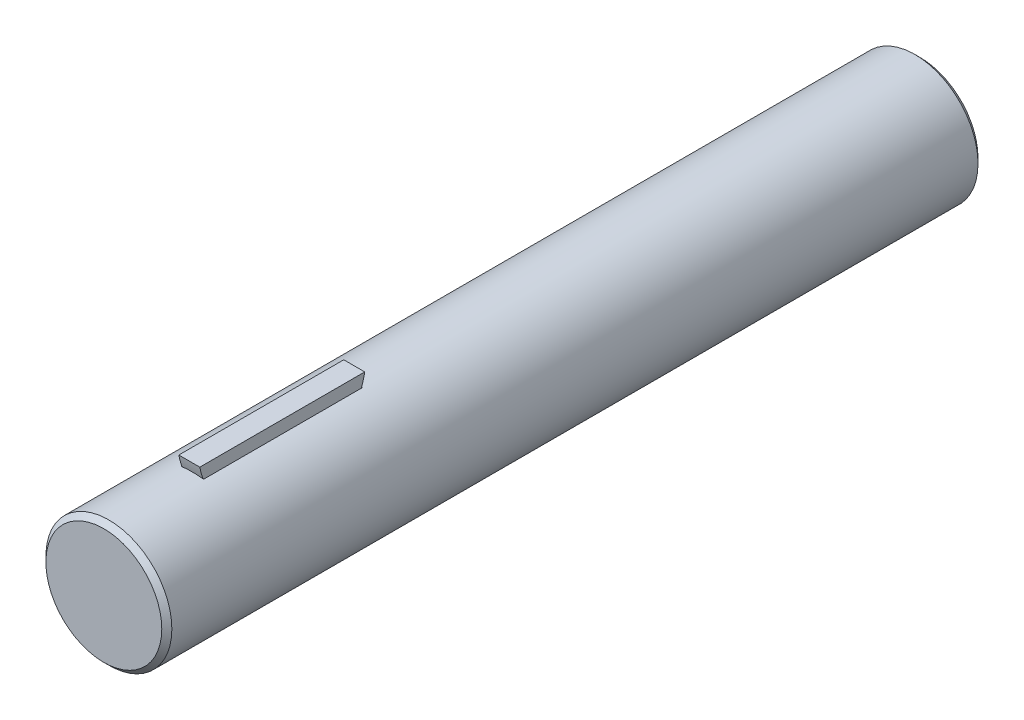
ISO-10303-21;
HEADER;
FILE_DESCRIPTION(('STEP AP214'),'2;1');
FILE_NAME('part.step','',(''),(''),'','','');
FILE_SCHEMA(('AUTOMOTIVE_DESIGN { 1 0 10303 214 1 1 1 1 }'));
ENDSEC;
DATA;
#1=APPLICATION_CONTEXT('core data for automotive mechanical design processes');
#2=APPLICATION_PROTOCOL_DEFINITION('international standard','automotive_design',2000,#1);
#3=PRODUCT_CONTEXT('',#1,'mechanical');
#4=PRODUCT('Part','Part','',(#3));
#5=PRODUCT_RELATED_PRODUCT_CATEGORY('part','',(#4));
#6=PRODUCT_DEFINITION_FORMATION('','',#4);
#7=PRODUCT_DEFINITION_CONTEXT('part definition',#1,'design');
#8=PRODUCT_DEFINITION('design','',#6,#7);
#9=PRODUCT_DEFINITION_SHAPE('','',#8);
#10=(LENGTH_UNIT() NAMED_UNIT(*) SI_UNIT(.MILLI.,.METRE.));
#11=(NAMED_UNIT(*) PLANE_ANGLE_UNIT() SI_UNIT($,.RADIAN.));
#12=(NAMED_UNIT(*) SI_UNIT($,.STERADIAN.) SOLID_ANGLE_UNIT());
#13=UNCERTAINTY_MEASURE_WITH_UNIT(LENGTH_MEASURE(1.E-05),#10,'distance_accuracy_value','');
#14=(GEOMETRIC_REPRESENTATION_CONTEXT(3) GLOBAL_UNCERTAINTY_ASSIGNED_CONTEXT((#13)) GLOBAL_UNIT_ASSIGNED_CONTEXT((#10,
#11,#12)) REPRESENTATION_CONTEXT('',''));
#15=CARTESIAN_POINT('',(0.,0.,0.));
#16=DIRECTION('',(0.,0.,1.));
#17=DIRECTION('',(1.,0.,0.));
#18=AXIS2_PLACEMENT_3D('',#15,#16,#17);
#19=CARTESIAN_POINT('',(-0.84455,6.77469380938872,31.623));
#20=DIRECTION('',(1.,0.,0.));
#21=DIRECTION('',(0.,0.,-1.));
#22=AXIS2_PLACEMENT_3D('',#19,#20,#21);
#23=CYLINDRICAL_SURFACE('',#22,6.35);
#24=CARTESIAN_POINT('',(-0.79375,6.77469380938872,31.623));
#25=DIRECTION('',(1.,0.,0.));
#26=DIRECTION('',(0.,0.,-1.));
#27=AXIS2_PLACEMENT_3D('',#24,#25,#26);
#28=CIRCLE('',#27,6.35);
#29=CARTESIAN_POINT('',(-0.79375,4.69588832783532,25.6229110198378));
#30=VERTEX_POINT('',#29);
#31=CARTESIAN_POINT('',(-0.79375,4.69588832783528,37.6230889801623));
#32=VERTEX_POINT('',#31);
#33=EDGE_CURVE('E42',#30,#32,#28,.F.);
#34=ORIENTED_EDGE('',*,*,#33,.F.);
#35=CARTESIAN_POINT('',(-0.84455,4.68701840699394,25.625991461217));
#36=CARTESIAN_POINT('',(-0.704848469321318,4.71221629983658,25.6172638180687));
#37=CARTESIAN_POINT('',(-0.563883269231341,4.73114237463684,25.6108088330229));
#38=CARTESIAN_POINT('',(-0.281938047237513,4.75622890974669,25.6023186504898));
#39=CARTESIAN_POINT('',(-0.140969023618757,4.7625,25.6002451425068));
#40=CARTESIAN_POINT('',(0.140969023618755,4.7625,25.6002451425068));
#41=CARTESIAN_POINT('',(0.281938047237511,4.75622890974669,25.6023186504898));
#42=CARTESIAN_POINT('',(0.563883269231338,4.73114237463684,25.6108088330229));
#43=CARTESIAN_POINT('',(0.704848469321315,4.71221629983658,25.6172638180687));
#44=CARTESIAN_POINT('',(0.844549999999998,4.68701840699394,25.625991461217));
#45=B_SPLINE_CURVE_WITH_KNOTS('',3,(#35,#36,#37,#38,#39,#40,#41,#42,#43,#44),.UNSPECIFIED.,.F.,
.F.,(4,2,2,2,4),(0.,0.426497298913169,0.84924971727627,1.27200213563937,1.69849943455254),.UNSPECIFIED.);
#46=CARTESIAN_POINT('',(-0.84455,4.68701840699394,25.625991461217));
#47=VERTEX_POINT('',#46);
#48=EDGE_CURVE('E150',#47,#30,#45,.T.);
#49=ORIENTED_EDGE('',*,*,#48,.F.);
#50=CARTESIAN_POINT('',(-0.84455,6.77469380938872,31.623));
#51=DIRECTION('',(1.,0.,0.));
#52=DIRECTION('',(0.,0.,-1.));
#53=AXIS2_PLACEMENT_3D('',#50,#51,#52);
#54=CIRCLE('',#53,6.35);
#55=CARTESIAN_POINT('',(-0.84455,4.68701840699394,37.620008538783));
#56=VERTEX_POINT('',#55);
#57=EDGE_CURVE('E121',#56,#47,#54,.T.);
#58=ORIENTED_EDGE('',*,*,#57,.F.);
#59=CARTESIAN_POINT('',(0.84455,4.68701840699394,37.620008538783));
#60=CARTESIAN_POINT('',(0.704848469321317,4.71221629983658,37.6287361819313));
#61=CARTESIAN_POINT('',(0.563883269231341,4.73114237463684,37.6351911669771));
#62=CARTESIAN_POINT('',(0.281938047237513,4.75622890974669,37.6436813495102));
#63=CARTESIAN_POINT('',(0.140969023618757,4.7625,37.6457548574932));
#64=CARTESIAN_POINT('',(-0.140969023618755,4.7625,37.6457548574932));
#65=CARTESIAN_POINT('',(-0.281938047237511,4.75622890974669,37.6436813495102));
#66=CARTESIAN_POINT('',(-0.563883269231338,4.73114237463684,37.6351911669771));
#67=CARTESIAN_POINT('',(-0.704848469321315,4.71221629983658,37.6287361819313));
#68=CARTESIAN_POINT('',(-0.844549999999998,4.68701840699394,37.620008538783));
#69=B_SPLINE_CURVE_WITH_KNOTS('',3,(#59,#60,#61,#62,#63,#64,#65,#66,#67,#68),.UNSPECIFIED.,.F.,
.F.,(4,2,2,2,4),(0.,0.42649729891317,0.84924971727627,1.27200213563937,1.69849943455254),.UNSPECIFIED.);
#70=EDGE_CURVE('E139',#32,#56,#69,.T.);
#71=ORIENTED_EDGE('',*,*,#70,.F.);
#72=EDGE_LOOP('',(#34,#49,#58,#71));
#73=FACE_BOUND('',#72,.T.);
#74=ADVANCED_FACE('F34',(#73),#23,.F.);
#75=CARTESIAN_POINT('',(0.,0.,-17.399));
#76=DIRECTION('',(0.,0.,1.));
#77=DIRECTION('',(1.,0.,0.));
#78=AXIS2_PLACEMENT_3D('',#75,#76,#77);
#79=CYLINDRICAL_SURFACE('',#78,4.7625);
#80=CARTESIAN_POINT('',(0.,0.,-17.018));
#81=DIRECTION('',(0.,0.,1.));
#82=DIRECTION('',(1.,0.,0.));
#83=AXIS2_PLACEMENT_3D('',#80,#81,#82);
#84=CIRCLE('',#83,4.7625);
#85=CARTESIAN_POINT('',(4.7625,0.,-17.018));
#86=VERTEX_POINT('',#85);
#87=EDGE_CURVE('E127',#86,#86,#84,.T.);
#88=ORIENTED_EDGE('',*,*,#87,.T.);
#89=EDGE_LOOP('',(#88));
#90=FACE_BOUND('',#89,.T.);
#91=CARTESIAN_POINT('',(0.,0.,43.942));
#92=DIRECTION('',(0.,0.,1.));
#93=DIRECTION('',(1.,0.,0.));
#94=AXIS2_PLACEMENT_3D('',#91,#92,#93);
#95=CIRCLE('',#94,4.7625);
#96=CARTESIAN_POINT('',(4.7625,0.,43.942));
#97=VERTEX_POINT('',#96);
#98=EDGE_CURVE('E130',#97,#97,#95,.T.);
#99=ORIENTED_EDGE('',*,*,#98,.F.);
#100=EDGE_LOOP('',(#99));
#101=FACE_BOUND('',#100,.T.);
#102=DIRECTION('',(0.,0.,1.));
#103=VECTOR('',#102,1.);
#104=CARTESIAN_POINT('',(-0.84455,4.68701840699394,-17.399));
#105=LINE('',#104,#103);
#106=EDGE_CURVE('E194',#47,#56,#105,.T.);
#107=ORIENTED_EDGE('',*,*,#106,.F.);
#108=ORIENTED_EDGE('',*,*,#48,.T.);
#109=CARTESIAN_POINT('',(0.79375,4.69588832783532,25.6229110198378));
#110=VERTEX_POINT('',#109);
#111=EDGE_CURVE('E93',#30,#110,#45,.T.);
#112=ORIENTED_EDGE('',*,*,#111,.T.);
#113=CARTESIAN_POINT('',(0.84455,4.68701840699394,25.625991461217));
#114=VERTEX_POINT('',#113);
#115=EDGE_CURVE('E148',#110,#114,#45,.T.);
#116=ORIENTED_EDGE('',*,*,#115,.T.);
#117=DIRECTION('',(0.,0.,1.));
#118=VECTOR('',#117,1.);
#119=CARTESIAN_POINT('',(0.84455,4.68701840699394,-17.399));
#120=LINE('',#119,#118);
#121=CARTESIAN_POINT('',(0.84455,4.68701840699394,37.620008538783));
#122=VERTEX_POINT('',#121);
#123=EDGE_CURVE('E136',#114,#122,#120,.T.);
#124=ORIENTED_EDGE('',*,*,#123,.T.);
#125=CARTESIAN_POINT('',(0.79375,4.69588832783532,37.6230889801622));
#126=VERTEX_POINT('',#125);
#127=EDGE_CURVE('E140',#122,#126,#69,.T.);
#128=ORIENTED_EDGE('',*,*,#127,.T.);
#129=EDGE_CURVE('E149',#126,#32,#69,.T.);
#130=ORIENTED_EDGE('',*,*,#129,.T.);
#131=ORIENTED_EDGE('',*,*,#70,.T.);
#132=EDGE_LOOP('',(#107,#108,#112,#116,#124,#128,#130,#131));
#133=FACE_BOUND('',#132,.T.);
#134=ADVANCED_FACE('F155',(#90,#101,#133),#79,.T.);
#135=CARTESIAN_POINT('',(0.,0.,44.323));
#136=DIRECTION('',(0.,0.,-1.));
#137=DIRECTION('',(-1.,0.,0.));
#138=AXIS2_PLACEMENT_3D('',#135,#136,#137);
#139=PLANE('',#138);
#140=CARTESIAN_POINT('',(0.,0.,44.323));
#141=DIRECTION('',(0.,0.,1.));
#142=DIRECTION('',(1.,0.,0.));
#143=AXIS2_PLACEMENT_3D('',#140,#141,#142);
#144=CIRCLE('',#143,4.3815);
#145=CARTESIAN_POINT('',(4.3815,0.,44.323));
#146=VERTEX_POINT('',#145);
#147=EDGE_CURVE('E133',#146,#146,#144,.T.);
#148=ORIENTED_EDGE('',*,*,#147,.T.);
#149=EDGE_LOOP('',(#148));
#150=FACE_BOUND('',#149,.T.);
#151=ADVANCED_FACE('F36',(#150),#139,.F.);
#152=CARTESIAN_POINT('',(0.,0.,43.942));
#153=DIRECTION('',(0.,0.,-1.));
#154=DIRECTION('',(-1.,0.,0.));
#155=AXIS2_PLACEMENT_3D('',#152,#153,#154);
#156=CONICAL_SURFACE('',#155,4.7625,0.785398163397459);
#157=ORIENTED_EDGE('',*,*,#147,.F.);
#158=EDGE_LOOP('',(#157));
#159=FACE_BOUND('',#158,.T.);
#160=ORIENTED_EDGE('',*,*,#98,.T.);
#161=EDGE_LOOP('',(#160));
#162=FACE_BOUND('',#161,.T.);
#163=ADVANCED_FACE('F172',(#159,#162),#156,.T.);
#164=CARTESIAN_POINT('',(0.,0.,-17.399));
#165=DIRECTION('',(0.,0.,1.));
#166=DIRECTION('',(1.,0.,0.));
#167=AXIS2_PLACEMENT_3D('',#164,#165,#166);
#168=CONICAL_SURFACE('',#167,4.3815,0.78539816339745);
#169=ORIENTED_EDGE('',*,*,#87,.F.);
#170=EDGE_LOOP('',(#169));
#171=FACE_BOUND('',#170,.T.);
#172=CARTESIAN_POINT('',(0.,0.,-17.399));
#173=DIRECTION('',(0.,0.,1.));
#174=DIRECTION('',(1.,0.,0.));
#175=AXIS2_PLACEMENT_3D('',#172,#173,#174);
#176=CIRCLE('',#175,4.3815);
#177=CARTESIAN_POINT('',(4.3815,0.,-17.399));
#178=VERTEX_POINT('',#177);
#179=EDGE_CURVE('E124',#178,#178,#176,.T.);
#180=ORIENTED_EDGE('',*,*,#179,.T.);
#181=EDGE_LOOP('',(#180));
#182=FACE_BOUND('',#181,.T.);
#183=ADVANCED_FACE('F169',(#171,#182),#168,.T.);
#184=CARTESIAN_POINT('',(0.,4.3815,-17.399));
#185=DIRECTION('',(0.,0.,1.));
#186=DIRECTION('',(1.,0.,0.));
#187=AXIS2_PLACEMENT_3D('',#184,#185,#186);
#188=PLANE('',#187);
#189=ORIENTED_EDGE('',*,*,#179,.F.);
#190=EDGE_LOOP('',(#189));
#191=FACE_BOUND('',#190,.T.);
#192=ADVANCED_FACE('F164',(#191),#188,.F.);
#193=ORIENTED_EDGE('',*,*,#115,.F.);
#194=CARTESIAN_POINT('',(0.79375,6.77469380938872,31.623));
#195=DIRECTION('',(1.,0.,0.));
#196=DIRECTION('',(0.,0.,-1.));
#197=AXIS2_PLACEMENT_3D('',#194,#195,#196);
#198=CIRCLE('',#197,6.35);
#199=EDGE_CURVE('E11',#110,#126,#198,.F.);
#200=ORIENTED_EDGE('',*,*,#199,.T.);
#201=ORIENTED_EDGE('',*,*,#127,.F.);
#202=CARTESIAN_POINT('',(0.84455,6.77469380938872,31.623));
#203=DIRECTION('',(1.,0.,0.));
#204=DIRECTION('',(0.,0.,-1.));
#205=AXIS2_PLACEMENT_3D('',#202,#203,#204);
#206=CIRCLE('',#205,6.35);
#207=EDGE_CURVE('E104',#122,#114,#206,.T.);
#208=ORIENTED_EDGE('',*,*,#207,.T.);
#209=EDGE_LOOP('',(#193,#200,#201,#208));
#210=FACE_BOUND('',#209,.T.);
#211=ADVANCED_FACE('F158',(#210),#23,.F.);
#212=CARTESIAN_POINT('',(-0.84455,6.77469380938872,31.623));
#213=DIRECTION('',(1.,0.,0.));
#214=DIRECTION('',(0.,0.,-1.));
#215=AXIS2_PLACEMENT_3D('',#212,#213,#214);
#216=PLANE('',#215);
#217=ORIENTED_EDGE('',*,*,#106,.T.);
#218=ORIENTED_EDGE('',*,*,#57,.T.);
#219=EDGE_LOOP('',(#217,#218));
#220=FACE_BOUND('',#219,.T.);
#221=ADVANCED_FACE('F163',(#220),#216,.T.);
#222=CARTESIAN_POINT('',(0.84455,6.77469380938872,31.623));
#223=DIRECTION('',(1.,0.,0.));
#224=DIRECTION('',(0.,0.,-1.));
#225=AXIS2_PLACEMENT_3D('',#222,#223,#224);
#226=PLANE('',#225);
#227=ORIENTED_EDGE('',*,*,#207,.F.);
#228=ORIENTED_EDGE('',*,*,#123,.F.);
#229=EDGE_LOOP('',(#227,#228));
#230=FACE_BOUND('',#229,.T.);
#231=ADVANCED_FACE('F199',(#230),#226,.F.);
#232=CARTESIAN_POINT('',(0.79375,6.77469380938766,31.6230000000009));
#233=DIRECTION('',(-1.,0.,0.));
#234=DIRECTION('',(0.,0.,1.));
#235=AXIS2_PLACEMENT_3D('',#232,#233,#234);
#236=CYLINDRICAL_SURFACE('',#235,6.34999999999892);
#237=CARTESIAN_POINT('',(-0.79375,6.77469380938766,31.6230000000009));
#238=DIRECTION('',(1.,0.,0.));
#239=DIRECTION('',(0.,0.,-1.));
#240=AXIS2_PLACEMENT_3D('',#237,#238,#239);
#241=CIRCLE('',#240,6.34999999999892);
#242=CARTESIAN_POINT('',(-0.79375,5.5753,37.8587));
#243=VERTEX_POINT('',#242);
#244=EDGE_CURVE('E97',#243,#32,#241,.T.);
#245=ORIENTED_EDGE('',*,*,#244,.T.);
#246=ORIENTED_EDGE('',*,*,#129,.F.);
#247=CARTESIAN_POINT('',(0.79375,6.77469380938766,31.6230000000009));
#248=DIRECTION('',(1.,0.,0.));
#249=DIRECTION('',(0.,0.,-1.));
#250=AXIS2_PLACEMENT_3D('',#247,#248,#249);
#251=CIRCLE('',#250,6.34999999999892);
#252=CARTESIAN_POINT('',(0.79375,5.5753,37.8587));
#253=VERTEX_POINT('',#252);
#254=EDGE_CURVE('E110',#253,#126,#251,.T.);
#255=ORIENTED_EDGE('',*,*,#254,.F.);
#256=DIRECTION('',(-1.,0.,0.));
#257=VECTOR('',#256,1.);
#258=CARTESIAN_POINT('',(0.79375,5.5753,37.8587));
#259=LINE('',#258,#257);
#260=EDGE_CURVE('E105',#253,#243,#259,.T.);
#261=ORIENTED_EDGE('',*,*,#260,.T.);
#262=EDGE_LOOP('',(#245,#246,#255,#261));
#263=FACE_BOUND('',#262,.T.);
#264=ADVANCED_FACE('F204',(#263),#236,.T.);
#265=CARTESIAN_POINT('',(0.79375,6.77469380938766,31.6230000000009));
#266=DIRECTION('',(-1.,0.,0.));
#267=DIRECTION('',(0.,0.,1.));
#268=AXIS2_PLACEMENT_3D('',#265,#266,#267);
#269=CYLINDRICAL_SURFACE('',#268,6.34999999999981);
#270=CARTESIAN_POINT('',(0.79375,6.77469380938766,31.6230000000009));
#271=DIRECTION('',(1.,0.,0.));
#272=DIRECTION('',(0.,0.,-1.));
#273=AXIS2_PLACEMENT_3D('',#270,#271,#272);
#274=CIRCLE('',#273,6.34999999999981);
#275=CARTESIAN_POINT('',(0.79375,5.5753,25.3873));
#276=VERTEX_POINT('',#275);
#277=EDGE_CURVE('E112',#110,#276,#274,.T.);
#278=ORIENTED_EDGE('',*,*,#277,.F.);
#279=ORIENTED_EDGE('',*,*,#111,.F.);
#280=CARTESIAN_POINT('',(-0.79375,6.77469380938766,31.6230000000009));
#281=DIRECTION('',(1.,0.,0.));
#282=DIRECTION('',(0.,0.,-1.));
#283=AXIS2_PLACEMENT_3D('',#280,#281,#282);
#284=CIRCLE('',#283,6.34999999999981);
#285=CARTESIAN_POINT('',(-0.79375,5.5753,25.3873));
#286=VERTEX_POINT('',#285);
#287=EDGE_CURVE('E86',#30,#286,#284,.T.);
#288=ORIENTED_EDGE('',*,*,#287,.T.);
#289=DIRECTION('',(-1.,0.,0.));
#290=VECTOR('',#289,1.);
#291=CARTESIAN_POINT('',(0.79375,5.5753,25.3873));
#292=LINE('',#291,#290);
#293=EDGE_CURVE('E90',#276,#286,#292,.T.);
#294=ORIENTED_EDGE('',*,*,#293,.F.);
#295=EDGE_LOOP('',(#278,#279,#288,#294));
#296=FACE_BOUND('',#295,.T.);
#297=ADVANCED_FACE('F89',(#296),#269,.T.);
#298=CARTESIAN_POINT('',(0.79375,6.77469380938766,31.6230000000009));
#299=DIRECTION('',(1.,0.,0.));
#300=DIRECTION('',(0.,0.,-1.));
#301=AXIS2_PLACEMENT_3D('',#298,#299,#300);
#302=PLANE('',#301);
#303=ORIENTED_EDGE('',*,*,#199,.F.);
#304=ORIENTED_EDGE('',*,*,#277,.T.);
#305=DIRECTION('',(0.,0.,1.));
#306=VECTOR('',#305,1.);
#307=CARTESIAN_POINT('',(0.79375,5.5753,25.3873));
#308=LINE('',#307,#306);
#309=EDGE_CURVE('E103',#276,#253,#308,.T.);
#310=ORIENTED_EDGE('',*,*,#309,.T.);
#311=ORIENTED_EDGE('',*,*,#254,.T.);
#312=EDGE_LOOP('',(#303,#304,#310,#311));
#313=FACE_BOUND('',#312,.T.);
#314=ADVANCED_FACE('F205',(#313),#302,.T.);
#315=CARTESIAN_POINT('',(-0.79375,6.77469380938766,31.6230000000009));
#316=DIRECTION('',(1.,0.,0.));
#317=DIRECTION('',(0.,0.,-1.));
#318=AXIS2_PLACEMENT_3D('',#315,#316,#317);
#319=PLANE('',#318);
#320=ORIENTED_EDGE('',*,*,#287,.F.);
#321=ORIENTED_EDGE('',*,*,#33,.T.);
#322=ORIENTED_EDGE('',*,*,#244,.F.);
#323=DIRECTION('',(0.,0.,1.));
#324=VECTOR('',#323,1.);
#325=CARTESIAN_POINT('',(-0.79375,5.5753,25.3873));
#326=LINE('',#325,#324);
#327=EDGE_CURVE('E96',#286,#243,#326,.T.);
#328=ORIENTED_EDGE('',*,*,#327,.F.);
#329=EDGE_LOOP('',(#320,#321,#322,#328));
#330=FACE_BOUND('',#329,.T.);
#331=ADVANCED_FACE('F108',(#330),#319,.F.);
#332=CARTESIAN_POINT('',(0.79375,5.5753,25.3873));
#333=DIRECTION('',(0.,-1.,0.));
#334=DIRECTION('',(0.,0.,-1.));
#335=AXIS2_PLACEMENT_3D('',#332,#333,#334);
#336=PLANE('',#335);
#337=ORIENTED_EDGE('',*,*,#293,.T.);
#338=ORIENTED_EDGE('',*,*,#327,.T.);
#339=ORIENTED_EDGE('',*,*,#260,.F.);
#340=ORIENTED_EDGE('',*,*,#309,.F.);
#341=EDGE_LOOP('',(#337,#338,#339,#340));
#342=FACE_BOUND('',#341,.T.);
#343=ADVANCED_FACE('F101',(#342),#336,.F.);
#344=CLOSED_SHELL('',(#74,#134,#151,#163,#183,#192,#211,#221,#231,#264,#297,#314,#331,#343));
#345=MANIFOLD_SOLID_BREP('B2',#344);
#346=ADVANCED_BREP_SHAPE_REPRESENTATION('',(#18,#345),#14);
#347=SHAPE_DEFINITION_REPRESENTATION(#9,#346);
ENDSEC;
END-ISO-10303-21;
